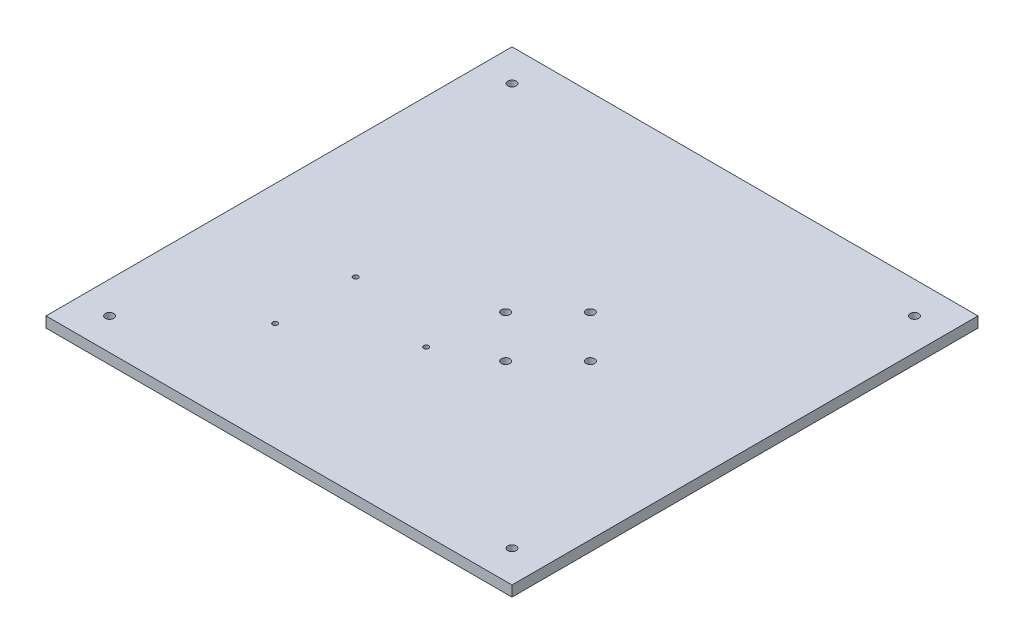
ISO-10303-21;
HEADER;
FILE_DESCRIPTION(('STEP AP214'),'2;1');
FILE_NAME('part.step','',(''),(''),'','','');
FILE_SCHEMA(('AUTOMOTIVE_DESIGN { 1 0 10303 214 1 1 1 1 }'));
ENDSEC;
DATA;
#1=APPLICATION_CONTEXT('core data for automotive mechanical design processes');
#2=APPLICATION_PROTOCOL_DEFINITION('international standard','automotive_design',2000,#1);
#3=PRODUCT_CONTEXT('',#1,'mechanical');
#4=PRODUCT('Part','Part','',(#3));
#5=PRODUCT_RELATED_PRODUCT_CATEGORY('part','',(#4));
#6=PRODUCT_DEFINITION_FORMATION('','',#4);
#7=PRODUCT_DEFINITION_CONTEXT('part definition',#1,'design');
#8=PRODUCT_DEFINITION('design','',#6,#7);
#9=PRODUCT_DEFINITION_SHAPE('','',#8);
#10=(LENGTH_UNIT() NAMED_UNIT(*) SI_UNIT(.MILLI.,.METRE.));
#11=(NAMED_UNIT(*) PLANE_ANGLE_UNIT() SI_UNIT($,.RADIAN.));
#12=(NAMED_UNIT(*) SI_UNIT($,.STERADIAN.) SOLID_ANGLE_UNIT());
#13=UNCERTAINTY_MEASURE_WITH_UNIT(LENGTH_MEASURE(1.E-05),#10,'distance_accuracy_value','');
#14=(GEOMETRIC_REPRESENTATION_CONTEXT(3) GLOBAL_UNCERTAINTY_ASSIGNED_CONTEXT((#13)) GLOBAL_UNIT_ASSIGNED_CONTEXT((#10,
#11,#12)) REPRESENTATION_CONTEXT('',''));
#15=CARTESIAN_POINT('',(0.,0.,0.));
#16=DIRECTION('',(0.,0.,1.));
#17=DIRECTION('',(1.,0.,0.));
#18=AXIS2_PLACEMENT_3D('',#15,#16,#17);
#19=CARTESIAN_POINT('',(-126.593135011442,6.35,-154.405263157895));
#20=DIRECTION('',(1.,0.,0.));
#21=DIRECTION('',(0.,0.,-1.));
#22=AXIS2_PLACEMENT_3D('',#19,#20,#21);
#23=PLANE('',#22);
#24=DIRECTION('',(0.,0.,1.));
#25=VECTOR('',#24,1.);
#26=CARTESIAN_POINT('',(-126.593135011442,0.,-154.405263157895));
#27=LINE('',#26,#25);
#28=CARTESIAN_POINT('',(-126.593135011442,0.,-154.405263157895));
#29=VERTEX_POINT('',#28);
#30=CARTESIAN_POINT('',(-126.593135011442,0.,124.994736842105));
#31=VERTEX_POINT('',#30);
#32=EDGE_CURVE('E99',#29,#31,#27,.T.);
#33=ORIENTED_EDGE('',*,*,#32,.T.);
#34=DIRECTION('',(0.,-1.,0.));
#35=VECTOR('',#34,1.);
#36=CARTESIAN_POINT('',(-126.593135011442,6.35,124.994736842105));
#37=LINE('',#36,#35);
#38=CARTESIAN_POINT('',(-126.593135011442,6.35,124.994736842105));
#39=VERTEX_POINT('',#38);
#40=EDGE_CURVE('E11',#39,#31,#37,.T.);
#41=ORIENTED_EDGE('',*,*,#40,.F.);
#42=DIRECTION('',(0.,0.,1.));
#43=VECTOR('',#42,1.);
#44=CARTESIAN_POINT('',(-126.593135011442,6.35,-154.405263157895));
#45=LINE('',#44,#43);
#46=CARTESIAN_POINT('',(-126.593135011442,6.35,-154.405263157895));
#47=VERTEX_POINT('',#46);
#48=EDGE_CURVE('E86',#47,#39,#45,.T.);
#49=ORIENTED_EDGE('',*,*,#48,.F.);
#50=DIRECTION('',(0.,-1.,0.));
#51=VECTOR('',#50,1.);
#52=CARTESIAN_POINT('',(-126.593135011442,6.35,-154.405263157895));
#53=LINE('',#52,#51);
#54=EDGE_CURVE('E95',#47,#29,#53,.T.);
#55=ORIENTED_EDGE('',*,*,#54,.T.);
#56=EDGE_LOOP('',(#33,#41,#49,#55));
#57=FACE_BOUND('',#56,.T.);
#58=ADVANCED_FACE('F33',(#57),#23,.F.);
#59=CARTESIAN_POINT('',(-126.593135011442,6.35,124.994736842105));
#60=DIRECTION('',(0.,0.,-1.));
#61=DIRECTION('',(-1.,0.,0.));
#62=AXIS2_PLACEMENT_3D('',#59,#60,#61);
#63=PLANE('',#62);
#64=DIRECTION('',(1.,0.,0.));
#65=VECTOR('',#64,1.);
#66=CARTESIAN_POINT('',(-126.593135011442,0.,124.994736842105));
#67=LINE('',#66,#65);
#68=CARTESIAN_POINT('',(152.806864988558,0.,124.994736842105));
#69=VERTEX_POINT('',#68);
#70=EDGE_CURVE('E90',#31,#69,#67,.T.);
#71=ORIENTED_EDGE('',*,*,#70,.T.);
#72=DIRECTION('',(0.,-1.,0.));
#73=VECTOR('',#72,1.);
#74=CARTESIAN_POINT('',(152.806864988558,6.35,124.994736842105));
#75=LINE('',#74,#73);
#76=CARTESIAN_POINT('',(152.806864988558,6.35,124.994736842105));
#77=VERTEX_POINT('',#76);
#78=EDGE_CURVE('E42',#77,#69,#75,.T.);
#79=ORIENTED_EDGE('',*,*,#78,.F.);
#80=DIRECTION('',(1.,0.,0.));
#81=VECTOR('',#80,1.);
#82=CARTESIAN_POINT('',(-126.593135011442,6.35,124.994736842105));
#83=LINE('',#82,#81);
#84=EDGE_CURVE('E81',#39,#77,#83,.T.);
#85=ORIENTED_EDGE('',*,*,#84,.F.);
#86=ORIENTED_EDGE('',*,*,#40,.T.);
#87=EDGE_LOOP('',(#71,#79,#85,#86));
#88=FACE_BOUND('',#87,.T.);
#89=ADVANCED_FACE('F89',(#88),#63,.F.);
#90=CARTESIAN_POINT('',(152.806864988558,6.35,-154.405263157895));
#91=DIRECTION('',(-1.,0.,0.));
#92=DIRECTION('',(0.,0.,1.));
#93=AXIS2_PLACEMENT_3D('',#90,#91,#92);
#94=PLANE('',#93);
#95=DIRECTION('',(0.,0.,-1.));
#96=VECTOR('',#95,1.);
#97=CARTESIAN_POINT('',(152.806864988558,0.,-154.405263157895));
#98=LINE('',#97,#96);
#99=CARTESIAN_POINT('',(152.806864988558,0.,-154.405263157895));
#100=VERTEX_POINT('',#99);
#101=EDGE_CURVE('E68',#69,#100,#98,.T.);
#102=ORIENTED_EDGE('',*,*,#101,.T.);
#103=DIRECTION('',(0.,-1.,0.));
#104=VECTOR('',#103,1.);
#105=CARTESIAN_POINT('',(152.806864988558,6.35,-154.405263157895));
#106=LINE('',#105,#104);
#107=CARTESIAN_POINT('',(152.806864988558,6.35,-154.405263157895));
#108=VERTEX_POINT('',#107);
#109=EDGE_CURVE('E91',#108,#100,#106,.T.);
#110=ORIENTED_EDGE('',*,*,#109,.F.);
#111=DIRECTION('',(0.,0.,-1.));
#112=VECTOR('',#111,1.);
#113=CARTESIAN_POINT('',(152.806864988558,6.35,-154.405263157895));
#114=LINE('',#113,#112);
#115=EDGE_CURVE('E84',#77,#108,#114,.T.);
#116=ORIENTED_EDGE('',*,*,#115,.F.);
#117=ORIENTED_EDGE('',*,*,#78,.T.);
#118=EDGE_LOOP('',(#102,#110,#116,#117));
#119=FACE_BOUND('',#118,.T.);
#120=ADVANCED_FACE('F93',(#119),#94,.F.);
#121=CARTESIAN_POINT('',(-126.593135011442,6.35,-154.405263157895));
#122=DIRECTION('',(0.,0.,1.));
#123=DIRECTION('',(1.,0.,0.));
#124=AXIS2_PLACEMENT_3D('',#121,#122,#123);
#125=PLANE('',#124);
#126=DIRECTION('',(-1.,0.,0.));
#127=VECTOR('',#126,1.);
#128=CARTESIAN_POINT('',(-126.593135011442,0.,-154.405263157895));
#129=LINE('',#128,#127);
#130=EDGE_CURVE('E74',#100,#29,#129,.T.);
#131=ORIENTED_EDGE('',*,*,#130,.T.);
#132=ORIENTED_EDGE('',*,*,#54,.F.);
#133=DIRECTION('',(-1.,0.,0.));
#134=VECTOR('',#133,1.);
#135=CARTESIAN_POINT('',(-126.593135011442,6.35,-154.405263157895));
#136=LINE('',#135,#134);
#137=EDGE_CURVE('E51',#108,#47,#136,.T.);
#138=ORIENTED_EDGE('',*,*,#137,.F.);
#139=ORIENTED_EDGE('',*,*,#109,.T.);
#140=EDGE_LOOP('',(#131,#132,#138,#139));
#141=FACE_BOUND('',#140,.T.);
#142=ADVANCED_FACE('F169',(#141),#125,.F.);
#143=CARTESIAN_POINT('',(0.,6.35,0.));
#144=DIRECTION('',(0.,1.,0.));
#145=DIRECTION('',(0.,0.,1.));
#146=AXIS2_PLACEMENT_3D('',#143,#144,#145);
#147=PLANE('',#146);
#148=CARTESIAN_POINT('',(34.6968649885583,6.35,-40.1052631578947));
#149=DIRECTION('',(0.,1.,0.));
#150=DIRECTION('',(0.,0.,1.));
#151=AXIS2_PLACEMENT_3D('',#148,#149,#150);
#152=CIRCLE('',#151,2.54);
#153=CARTESIAN_POINT('',(34.6968649885583,6.35,-37.5652631578947));
#154=VERTEX_POINT('',#153);
#155=EDGE_CURVE('E123',#154,#154,#152,.T.);
#156=ORIENTED_EDGE('',*,*,#155,.F.);
#157=EDGE_LOOP('',(#156));
#158=FACE_BOUND('',#157,.T.);
#159=CARTESIAN_POINT('',(60.0968649885583,6.35,-14.7052631578947));
#160=DIRECTION('',(0.,1.,0.));
#161=DIRECTION('',(0.,0.,1.));
#162=AXIS2_PLACEMENT_3D('',#159,#160,#161);
#163=CIRCLE('',#162,2.54);
#164=CARTESIAN_POINT('',(60.0968649885583,6.35,-12.1652631578947));
#165=VERTEX_POINT('',#164);
#166=EDGE_CURVE('E321',#165,#165,#163,.T.);
#167=ORIENTED_EDGE('',*,*,#166,.F.);
#168=EDGE_LOOP('',(#167));
#169=FACE_BOUND('',#168,.T.);
#170=CARTESIAN_POINT('',(34.6968649885583,6.35,10.6947368421053));
#171=DIRECTION('',(0.,1.,0.));
#172=DIRECTION('',(0.,0.,1.));
#173=AXIS2_PLACEMENT_3D('',#170,#171,#172);
#174=CIRCLE('',#173,2.54);
#175=CARTESIAN_POINT('',(34.6968649885583,6.35,13.2347368421053));
#176=VERTEX_POINT('',#175);
#177=EDGE_CURVE('E324',#176,#176,#174,.T.);
#178=ORIENTED_EDGE('',*,*,#177,.F.);
#179=EDGE_LOOP('',(#178));
#180=FACE_BOUND('',#179,.T.);
#181=CARTESIAN_POINT('',(9.29686498855829,6.35,-14.7052631578947));
#182=DIRECTION('',(0.,1.,0.));
#183=DIRECTION('',(0.,0.,1.));
#184=AXIS2_PLACEMENT_3D('',#181,#182,#183);
#185=CIRCLE('',#184,2.54);
#186=CARTESIAN_POINT('',(9.29686498855829,6.35,-12.1652631578947));
#187=VERTEX_POINT('',#186);
#188=EDGE_CURVE('E329',#187,#187,#185,.T.);
#189=ORIENTED_EDGE('',*,*,#188,.F.);
#190=EDGE_LOOP('',(#189));
#191=FACE_BOUND('',#190,.T.);
#192=CARTESIAN_POINT('',(-53.9831350114417,6.35,11.9647368651052));
#193=DIRECTION('',(0.,1.,0.));
#194=DIRECTION('',(0.,0.,1.));
#195=AXIS2_PLACEMENT_3D('',#192,#193,#194);
#196=CIRCLE('',#195,1.5);
#197=CARTESIAN_POINT('',(-53.9831350114417,6.35,13.4647368651052));
#198=VERTEX_POINT('',#197);
#199=EDGE_CURVE('E112',#198,#198,#196,.T.);
#200=ORIENTED_EDGE('',*,*,#199,.F.);
#201=EDGE_LOOP('',(#200));
#202=FACE_BOUND('',#201,.T.);
#203=CARTESIAN_POINT('',(-53.9831350114417,6.35,60.2247368191053));
#204=DIRECTION('',(0.,1.,0.));
#205=DIRECTION('',(0.,0.,1.));
#206=AXIS2_PLACEMENT_3D('',#203,#204,#205);
#207=CIRCLE('',#206,1.5);
#208=CARTESIAN_POINT('',(-53.9831350114417,6.35,61.7247368191052));
#209=VERTEX_POINT('',#208);
#210=EDGE_CURVE('E134',#209,#209,#207,.T.);
#211=ORIENTED_EDGE('',*,*,#210,.F.);
#212=EDGE_LOOP('',(#211));
#213=FACE_BOUND('',#212,.T.);
#214=CARTESIAN_POINT('',(3.55686498855827,6.35,27.2047367151052));
#215=DIRECTION('',(0.,1.,0.));
#216=DIRECTION('',(0.,0.,1.));
#217=AXIS2_PLACEMENT_3D('',#214,#215,#216);
#218=CIRCLE('',#217,1.5);
#219=CARTESIAN_POINT('',(3.55686498855827,6.35,28.7047367151053));
#220=VERTEX_POINT('',#219);
#221=EDGE_CURVE('E130',#220,#220,#218,.T.);
#222=ORIENTED_EDGE('',*,*,#221,.F.);
#223=EDGE_LOOP('',(#222));
#224=FACE_BOUND('',#223,.T.);
#225=CARTESIAN_POINT('',(133.756864988558,6.35,-135.355263157895));
#226=DIRECTION('',(0.,1.,0.));
#227=DIRECTION('',(0.,0.,1.));
#228=AXIS2_PLACEMENT_3D('',#225,#226,#227);
#229=CIRCLE('',#228,2.53999999999998);
#230=CARTESIAN_POINT('',(133.756864988558,6.35,-132.815263157895));
#231=VERTEX_POINT('',#230);
#232=EDGE_CURVE('E152',#231,#231,#229,.T.);
#233=ORIENTED_EDGE('',*,*,#232,.F.);
#234=EDGE_LOOP('',(#233));
#235=FACE_BOUND('',#234,.T.);
#236=CARTESIAN_POINT('',(-107.543135011442,6.35,105.944736842105));
#237=DIRECTION('',(0.,1.,0.));
#238=DIRECTION('',(0.,0.,1.));
#239=AXIS2_PLACEMENT_3D('',#236,#237,#238);
#240=CIRCLE('',#239,2.53999999999999);
#241=CARTESIAN_POINT('',(-107.543135011442,6.35,108.484736842105));
#242=VERTEX_POINT('',#241);
#243=EDGE_CURVE('E145',#242,#242,#240,.T.);
#244=ORIENTED_EDGE('',*,*,#243,.F.);
#245=EDGE_LOOP('',(#244));
#246=FACE_BOUND('',#245,.T.);
#247=CARTESIAN_POINT('',(133.756864988558,6.35,105.944736842105));
#248=DIRECTION('',(0.,1.,0.));
#249=DIRECTION('',(0.,0.,1.));
#250=AXIS2_PLACEMENT_3D('',#247,#248,#249);
#251=CIRCLE('',#250,2.53999999999998);
#252=CARTESIAN_POINT('',(133.756864988558,6.35,108.484736842105));
#253=VERTEX_POINT('',#252);
#254=EDGE_CURVE('E118',#253,#253,#251,.T.);
#255=ORIENTED_EDGE('',*,*,#254,.F.);
#256=EDGE_LOOP('',(#255));
#257=FACE_BOUND('',#256,.T.);
#258=CARTESIAN_POINT('',(-107.543135011442,6.35,-135.355263157895));
#259=DIRECTION('',(0.,1.,0.));
#260=DIRECTION('',(0.,0.,1.));
#261=AXIS2_PLACEMENT_3D('',#258,#259,#260);
#262=CIRCLE('',#261,2.54);
#263=CARTESIAN_POINT('',(-107.543135011442,6.35,-132.815263157895));
#264=VERTEX_POINT('',#263);
#265=EDGE_CURVE('E151',#264,#264,#262,.T.);
#266=ORIENTED_EDGE('',*,*,#265,.F.);
#267=EDGE_LOOP('',(#266));
#268=FACE_BOUND('',#267,.T.);
#269=ORIENTED_EDGE('',*,*,#48,.T.);
#270=ORIENTED_EDGE('',*,*,#84,.T.);
#271=ORIENTED_EDGE('',*,*,#115,.T.);
#272=ORIENTED_EDGE('',*,*,#137,.T.);
#273=EDGE_LOOP('',(#269,#270,#271,#272));
#274=FACE_BOUND('',#273,.T.);
#275=ADVANCED_FACE('F82',(#158,#169,#180,#191,#202,#213,#224,#235,#246,#257,#268,#274),#147,.T.);
#276=CARTESIAN_POINT('',(0.,0.,0.));
#277=DIRECTION('',(0.,1.,0.));
#278=DIRECTION('',(0.,0.,1.));
#279=AXIS2_PLACEMENT_3D('',#276,#277,#278);
#280=PLANE('',#279);
#281=CARTESIAN_POINT('',(34.6968649885583,0.,-40.1052631578947));
#282=DIRECTION('',(0.,1.,0.));
#283=DIRECTION('',(0.,0.,1.));
#284=AXIS2_PLACEMENT_3D('',#281,#282,#283);
#285=CIRCLE('',#284,2.54);
#286=CARTESIAN_POINT('',(34.6968649885583,0.,-37.5652631578947));
#287=VERTEX_POINT('',#286);
#288=EDGE_CURVE('E36',#287,#287,#285,.T.);
#289=ORIENTED_EDGE('',*,*,#288,.T.);
#290=EDGE_LOOP('',(#289));
#291=FACE_BOUND('',#290,.T.);
#292=CARTESIAN_POINT('',(60.0968649885583,0.,-14.7052631578947));
#293=DIRECTION('',(0.,1.,0.));
#294=DIRECTION('',(0.,0.,1.));
#295=AXIS2_PLACEMENT_3D('',#292,#293,#294);
#296=CIRCLE('',#295,2.54);
#297=CARTESIAN_POINT('',(60.0968649885583,0.,-12.1652631578947));
#298=VERTEX_POINT('',#297);
#299=EDGE_CURVE('E125',#298,#298,#296,.T.);
#300=ORIENTED_EDGE('',*,*,#299,.T.);
#301=EDGE_LOOP('',(#300));
#302=FACE_BOUND('',#301,.T.);
#303=CARTESIAN_POINT('',(34.6968649885583,0.,10.6947368421053));
#304=DIRECTION('',(0.,1.,0.));
#305=DIRECTION('',(0.,0.,1.));
#306=AXIS2_PLACEMENT_3D('',#303,#304,#305);
#307=CIRCLE('',#306,2.54);
#308=CARTESIAN_POINT('',(34.6968649885583,0.,13.2347368421053));
#309=VERTEX_POINT('',#308);
#310=EDGE_CURVE('E122',#309,#309,#307,.T.);
#311=ORIENTED_EDGE('',*,*,#310,.T.);
#312=EDGE_LOOP('',(#311));
#313=FACE_BOUND('',#312,.T.);
#314=CARTESIAN_POINT('',(9.29686498855829,0.,-14.7052631578947));
#315=DIRECTION('',(0.,1.,0.));
#316=DIRECTION('',(0.,0.,1.));
#317=AXIS2_PLACEMENT_3D('',#314,#315,#316);
#318=CIRCLE('',#317,2.54);
#319=CARTESIAN_POINT('',(9.29686498855829,0.,-12.1652631578947));
#320=VERTEX_POINT('',#319);
#321=EDGE_CURVE('E119',#320,#320,#318,.T.);
#322=ORIENTED_EDGE('',*,*,#321,.T.);
#323=EDGE_LOOP('',(#322));
#324=FACE_BOUND('',#323,.T.);
#325=CARTESIAN_POINT('',(-53.9831350114417,0.,11.9647368651052));
#326=DIRECTION('',(0.,1.,0.));
#327=DIRECTION('',(0.,0.,1.));
#328=AXIS2_PLACEMENT_3D('',#325,#326,#327);
#329=CIRCLE('',#328,1.5);
#330=CARTESIAN_POINT('',(-53.9831350114417,0.,13.4647368651052));
#331=VERTEX_POINT('',#330);
#332=EDGE_CURVE('E115',#331,#331,#329,.T.);
#333=ORIENTED_EDGE('',*,*,#332,.T.);
#334=EDGE_LOOP('',(#333));
#335=FACE_BOUND('',#334,.T.);
#336=CARTESIAN_POINT('',(-53.9831350114417,0.,60.2247368191053));
#337=DIRECTION('',(0.,1.,0.));
#338=DIRECTION('',(0.,0.,1.));
#339=AXIS2_PLACEMENT_3D('',#336,#337,#338);
#340=CIRCLE('',#339,1.5);
#341=CARTESIAN_POINT('',(-53.9831350114417,0.,61.7247368191052));
#342=VERTEX_POINT('',#341);
#343=EDGE_CURVE('E111',#342,#342,#340,.T.);
#344=ORIENTED_EDGE('',*,*,#343,.T.);
#345=EDGE_LOOP('',(#344));
#346=FACE_BOUND('',#345,.T.);
#347=CARTESIAN_POINT('',(3.55686498855827,0.,27.2047367151052));
#348=DIRECTION('',(0.,1.,0.));
#349=DIRECTION('',(0.,0.,1.));
#350=AXIS2_PLACEMENT_3D('',#347,#348,#349);
#351=CIRCLE('',#350,1.5);
#352=CARTESIAN_POINT('',(3.55686498855827,0.,28.7047367151053));
#353=VERTEX_POINT('',#352);
#354=EDGE_CURVE('E108',#353,#353,#351,.T.);
#355=ORIENTED_EDGE('',*,*,#354,.T.);
#356=EDGE_LOOP('',(#355));
#357=FACE_BOUND('',#356,.T.);
#358=CARTESIAN_POINT('',(133.756864988558,0.,-135.355263157895));
#359=DIRECTION('',(0.,1.,0.));
#360=DIRECTION('',(0.,0.,1.));
#361=AXIS2_PLACEMENT_3D('',#358,#359,#360);
#362=CIRCLE('',#361,2.53999999999998);
#363=CARTESIAN_POINT('',(133.756864988558,0.,-132.815263157895));
#364=VERTEX_POINT('',#363);
#365=EDGE_CURVE('E148',#364,#364,#362,.T.);
#366=ORIENTED_EDGE('',*,*,#365,.T.);
#367=EDGE_LOOP('',(#366));
#368=FACE_BOUND('',#367,.T.);
#369=CARTESIAN_POINT('',(-107.543135011442,0.,105.944736842105));
#370=DIRECTION('',(0.,1.,0.));
#371=DIRECTION('',(0.,0.,1.));
#372=AXIS2_PLACEMENT_3D('',#369,#370,#371);
#373=CIRCLE('',#372,2.53999999999999);
#374=CARTESIAN_POINT('',(-107.543135011442,0.,108.484736842105));
#375=VERTEX_POINT('',#374);
#376=EDGE_CURVE('E155',#375,#375,#373,.T.);
#377=ORIENTED_EDGE('',*,*,#376,.T.);
#378=EDGE_LOOP('',(#377));
#379=FACE_BOUND('',#378,.T.);
#380=CARTESIAN_POINT('',(133.756864988558,0.,105.944736842105));
#381=DIRECTION('',(0.,1.,0.));
#382=DIRECTION('',(0.,0.,1.));
#383=AXIS2_PLACEMENT_3D('',#380,#381,#382);
#384=CIRCLE('',#383,2.53999999999998);
#385=CARTESIAN_POINT('',(133.756864988558,0.,108.484736842105));
#386=VERTEX_POINT('',#385);
#387=EDGE_CURVE('E142',#386,#386,#384,.T.);
#388=ORIENTED_EDGE('',*,*,#387,.T.);
#389=EDGE_LOOP('',(#388));
#390=FACE_BOUND('',#389,.T.);
#391=CARTESIAN_POINT('',(-107.543135011442,0.,-135.355263157895));
#392=DIRECTION('',(0.,1.,0.));
#393=DIRECTION('',(0.,0.,1.));
#394=AXIS2_PLACEMENT_3D('',#391,#392,#393);
#395=CIRCLE('',#394,2.54);
#396=CARTESIAN_POINT('',(-107.543135011442,0.,-132.815263157895));
#397=VERTEX_POINT('',#396);
#398=EDGE_CURVE('E102',#397,#397,#395,.T.);
#399=ORIENTED_EDGE('',*,*,#398,.T.);
#400=EDGE_LOOP('',(#399));
#401=FACE_BOUND('',#400,.T.);
#402=ORIENTED_EDGE('',*,*,#32,.F.);
#403=ORIENTED_EDGE('',*,*,#130,.F.);
#404=ORIENTED_EDGE('',*,*,#101,.F.);
#405=ORIENTED_EDGE('',*,*,#70,.F.);
#406=EDGE_LOOP('',(#402,#403,#404,#405));
#407=FACE_BOUND('',#406,.T.);
#408=ADVANCED_FACE('F168',(#291,#302,#313,#324,#335,#346,#357,#368,#379,#390,#401,#407),#280,.F.);
#409=CARTESIAN_POINT('',(-107.543135011442,0.,-135.355263157895));
#410=DIRECTION('',(0.,1.,0.));
#411=DIRECTION('',(0.,0.,1.));
#412=AXIS2_PLACEMENT_3D('',#409,#410,#411);
#413=CYLINDRICAL_SURFACE('',#412,2.54);
#414=ORIENTED_EDGE('',*,*,#398,.F.);
#415=EDGE_LOOP('',(#414));
#416=FACE_BOUND('',#415,.T.);
#417=ORIENTED_EDGE('',*,*,#265,.T.);
#418=EDGE_LOOP('',(#417));
#419=FACE_BOUND('',#418,.T.);
#420=ADVANCED_FACE('F165',(#416,#419),#413,.F.);
#421=CARTESIAN_POINT('',(133.756864988558,0.,105.944736842105));
#422=DIRECTION('',(0.,1.,0.));
#423=DIRECTION('',(0.,0.,1.));
#424=AXIS2_PLACEMENT_3D('',#421,#422,#423);
#425=CYLINDRICAL_SURFACE('',#424,2.53999999999998);
#426=ORIENTED_EDGE('',*,*,#387,.F.);
#427=EDGE_LOOP('',(#426));
#428=FACE_BOUND('',#427,.T.);
#429=ORIENTED_EDGE('',*,*,#254,.T.);
#430=EDGE_LOOP('',(#429));
#431=FACE_BOUND('',#430,.T.);
#432=ADVANCED_FACE('F208',(#428,#431),#425,.F.);
#433=CARTESIAN_POINT('',(-107.543135011442,0.,105.944736842105));
#434=DIRECTION('',(0.,1.,0.));
#435=DIRECTION('',(0.,0.,1.));
#436=AXIS2_PLACEMENT_3D('',#433,#434,#435);
#437=CYLINDRICAL_SURFACE('',#436,2.53999999999999);
#438=ORIENTED_EDGE('',*,*,#376,.F.);
#439=EDGE_LOOP('',(#438));
#440=FACE_BOUND('',#439,.T.);
#441=ORIENTED_EDGE('',*,*,#243,.T.);
#442=EDGE_LOOP('',(#441));
#443=FACE_BOUND('',#442,.T.);
#444=ADVANCED_FACE('F218',(#440,#443),#437,.F.);
#445=CARTESIAN_POINT('',(133.756864988558,0.,-135.355263157895));
#446=DIRECTION('',(0.,1.,0.));
#447=DIRECTION('',(0.,0.,1.));
#448=AXIS2_PLACEMENT_3D('',#445,#446,#447);
#449=CYLINDRICAL_SURFACE('',#448,2.53999999999998);
#450=ORIENTED_EDGE('',*,*,#365,.F.);
#451=EDGE_LOOP('',(#450));
#452=FACE_BOUND('',#451,.T.);
#453=ORIENTED_EDGE('',*,*,#232,.T.);
#454=EDGE_LOOP('',(#453));
#455=FACE_BOUND('',#454,.T.);
#456=ADVANCED_FACE('F228',(#452,#455),#449,.F.);
#457=CARTESIAN_POINT('',(3.55686498855827,-120.65,27.2047367151052));
#458=DIRECTION('',(0.,1.,0.));
#459=DIRECTION('',(0.,0.,1.));
#460=AXIS2_PLACEMENT_3D('',#457,#458,#459);
#461=CYLINDRICAL_SURFACE('',#460,1.5);
#462=ORIENTED_EDGE('',*,*,#221,.T.);
#463=EDGE_LOOP('',(#462));
#464=FACE_BOUND('',#463,.T.);
#465=ORIENTED_EDGE('',*,*,#354,.F.);
#466=EDGE_LOOP('',(#465));
#467=FACE_BOUND('',#466,.T.);
#468=ADVANCED_FACE('F238',(#464,#467),#461,.F.);
#469=CARTESIAN_POINT('',(-53.9831350114417,-120.65,60.2247368191053));
#470=DIRECTION('',(0.,1.,0.));
#471=DIRECTION('',(0.,0.,1.));
#472=AXIS2_PLACEMENT_3D('',#469,#470,#471);
#473=CYLINDRICAL_SURFACE('',#472,1.5);
#474=ORIENTED_EDGE('',*,*,#210,.T.);
#475=EDGE_LOOP('',(#474));
#476=FACE_BOUND('',#475,.T.);
#477=ORIENTED_EDGE('',*,*,#343,.F.);
#478=EDGE_LOOP('',(#477));
#479=FACE_BOUND('',#478,.T.);
#480=ADVANCED_FACE('F248',(#476,#479),#473,.F.);
#481=CARTESIAN_POINT('',(-53.9831350114417,-120.65,11.9647368651052));
#482=DIRECTION('',(0.,1.,0.));
#483=DIRECTION('',(0.,0.,1.));
#484=AXIS2_PLACEMENT_3D('',#481,#482,#483);
#485=CYLINDRICAL_SURFACE('',#484,1.5);
#486=ORIENTED_EDGE('',*,*,#199,.T.);
#487=EDGE_LOOP('',(#486));
#488=FACE_BOUND('',#487,.T.);
#489=ORIENTED_EDGE('',*,*,#332,.F.);
#490=EDGE_LOOP('',(#489));
#491=FACE_BOUND('',#490,.T.);
#492=ADVANCED_FACE('F257',(#488,#491),#485,.F.);
#493=CARTESIAN_POINT('',(9.29686498855829,-30.226,-14.7052631578947));
#494=DIRECTION('',(0.,1.,0.));
#495=DIRECTION('',(0.,0.,1.));
#496=AXIS2_PLACEMENT_3D('',#493,#494,#495);
#497=CYLINDRICAL_SURFACE('',#496,2.54);
#498=ORIENTED_EDGE('',*,*,#188,.T.);
#499=EDGE_LOOP('',(#498));
#500=FACE_BOUND('',#499,.T.);
#501=ORIENTED_EDGE('',*,*,#321,.F.);
#502=EDGE_LOOP('',(#501));
#503=FACE_BOUND('',#502,.T.);
#504=ADVANCED_FACE('F266',(#500,#503),#497,.F.);
#505=CARTESIAN_POINT('',(34.6968649885583,-30.226,10.6947368421053));
#506=DIRECTION('',(0.,1.,0.));
#507=DIRECTION('',(0.,0.,1.));
#508=AXIS2_PLACEMENT_3D('',#505,#506,#507);
#509=CYLINDRICAL_SURFACE('',#508,2.54);
#510=ORIENTED_EDGE('',*,*,#177,.T.);
#511=EDGE_LOOP('',(#510));
#512=FACE_BOUND('',#511,.T.);
#513=ORIENTED_EDGE('',*,*,#310,.F.);
#514=EDGE_LOOP('',(#513));
#515=FACE_BOUND('',#514,.T.);
#516=ADVANCED_FACE('F285',(#512,#515),#509,.F.);
#517=CARTESIAN_POINT('',(60.0968649885583,-30.226,-14.7052631578947));
#518=DIRECTION('',(0.,1.,0.));
#519=DIRECTION('',(0.,0.,1.));
#520=AXIS2_PLACEMENT_3D('',#517,#518,#519);
#521=CYLINDRICAL_SURFACE('',#520,2.54);
#522=ORIENTED_EDGE('',*,*,#166,.T.);
#523=EDGE_LOOP('',(#522));
#524=FACE_BOUND('',#523,.T.);
#525=ORIENTED_EDGE('',*,*,#299,.F.);
#526=EDGE_LOOP('',(#525));
#527=FACE_BOUND('',#526,.T.);
#528=ADVANCED_FACE('F295',(#524,#527),#521,.F.);
#529=CARTESIAN_POINT('',(34.6968649885583,-30.226,-40.1052631578947));
#530=DIRECTION('',(0.,1.,0.));
#531=DIRECTION('',(0.,0.,1.));
#532=AXIS2_PLACEMENT_3D('',#529,#530,#531);
#533=CYLINDRICAL_SURFACE('',#532,2.54);
#534=ORIENTED_EDGE('',*,*,#155,.T.);
#535=EDGE_LOOP('',(#534));
#536=FACE_BOUND('',#535,.T.);
#537=ORIENTED_EDGE('',*,*,#288,.F.);
#538=EDGE_LOOP('',(#537));
#539=FACE_BOUND('',#538,.T.);
#540=ADVANCED_FACE('F305',(#536,#539),#533,.F.);
#541=CLOSED_SHELL('',(#58,#89,#120,#142,#275,#408,#420,#432,#444,#456,#468,#480,#492,#504,#516,
#528,#540));
#542=MANIFOLD_SOLID_BREP('B2',#541);
#543=ADVANCED_BREP_SHAPE_REPRESENTATION('',(#18,#542),#14);
#544=SHAPE_DEFINITION_REPRESENTATION(#9,#543);
ENDSEC;
END-ISO-10303-21;
